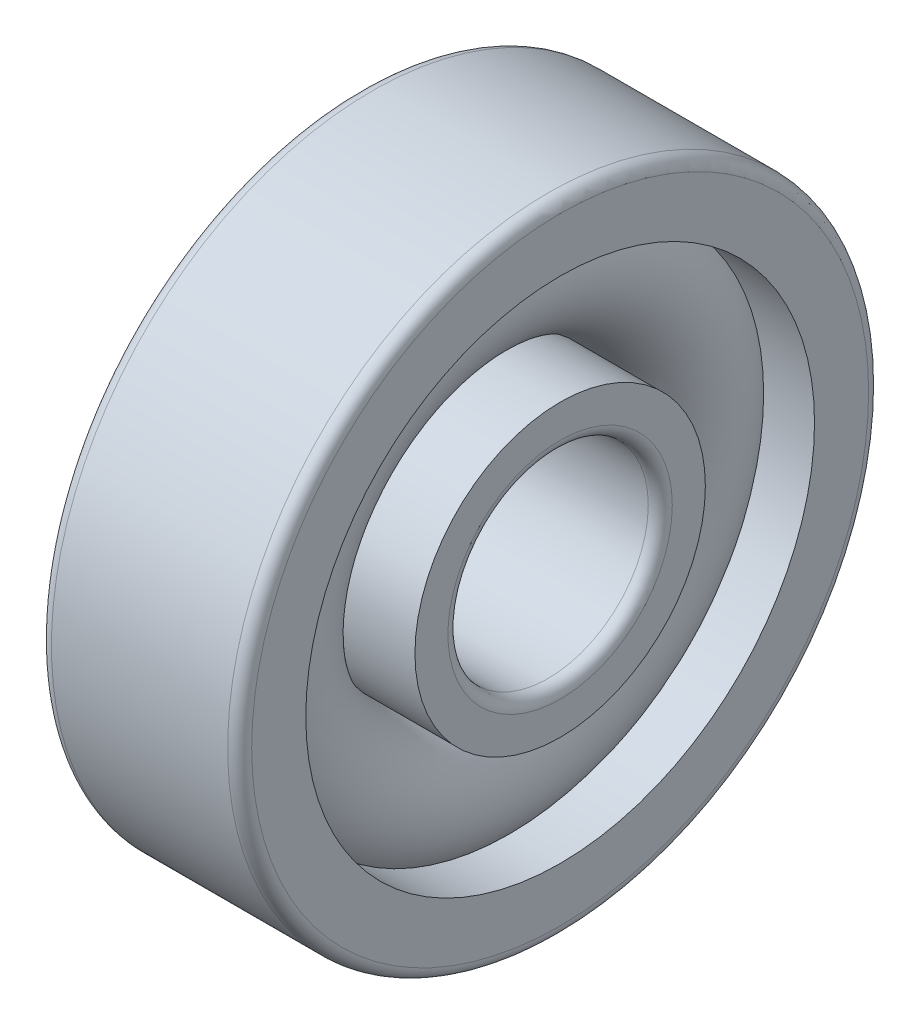
ISO-10303-21;
HEADER;
FILE_DESCRIPTION(('STEP AP214'),'2;1');
FILE_NAME('part.step','',(''),(''),'','','');
FILE_SCHEMA(('AUTOMOTIVE_DESIGN { 1 0 10303 214 1 1 1 1 }'));
ENDSEC;
DATA;
#1=APPLICATION_CONTEXT('core data for automotive mechanical design processes');
#2=APPLICATION_PROTOCOL_DEFINITION('international standard','automotive_design',2000,#1);
#3=PRODUCT_CONTEXT('',#1,'mechanical');
#4=PRODUCT('Part','Part','',(#3));
#5=PRODUCT_RELATED_PRODUCT_CATEGORY('part','',(#4));
#6=PRODUCT_DEFINITION_FORMATION('','',#4);
#7=PRODUCT_DEFINITION_CONTEXT('part definition',#1,'design');
#8=PRODUCT_DEFINITION('design','',#6,#7);
#9=PRODUCT_DEFINITION_SHAPE('','',#8);
#10=(LENGTH_UNIT() NAMED_UNIT(*) SI_UNIT(.MILLI.,.METRE.));
#11=(NAMED_UNIT(*) PLANE_ANGLE_UNIT() SI_UNIT($,.RADIAN.));
#12=(NAMED_UNIT(*) SI_UNIT($,.STERADIAN.) SOLID_ANGLE_UNIT());
#13=UNCERTAINTY_MEASURE_WITH_UNIT(LENGTH_MEASURE(1.E-05),#10,'distance_accuracy_value','');
#14=(GEOMETRIC_REPRESENTATION_CONTEXT(3) GLOBAL_UNCERTAINTY_ASSIGNED_CONTEXT((#13)) GLOBAL_UNIT_ASSIGNED_CONTEXT((#10,
#11,#12)) REPRESENTATION_CONTEXT('',''));
#15=CARTESIAN_POINT('',(0.,0.,0.));
#16=DIRECTION('',(0.,0.,1.));
#17=DIRECTION('',(1.,0.,0.));
#18=AXIS2_PLACEMENT_3D('',#15,#16,#17);
#19=CARTESIAN_POINT('',(0.,0.,0.));
#20=DIRECTION('',(-1.,0.,0.));
#21=DIRECTION('',(0.,0.,1.));
#22=AXIS2_PLACEMENT_3D('',#19,#20,#21);
#23=TOROIDAL_SURFACE('',#22,5.25,1.65);
#24=CARTESIAN_POINT('',(1.22983738762488,0.,0.));
#25=DIRECTION('',(-1.,0.,0.));
#26=DIRECTION('',(0.,0.,1.));
#27=AXIS2_PLACEMENT_3D('',#24,#25,#26);
#28=CIRCLE('',#27,6.35);
#29=CARTESIAN_POINT('',(1.22983738762488,0.,6.35));
#30=VERTEX_POINT('',#29);
#31=EDGE_CURVE('E36',#30,#30,#28,.F.);
#32=ORIENTED_EDGE('',*,*,#31,.T.);
#33=EDGE_LOOP('',(#32));
#34=FACE_BOUND('',#33,.T.);
#35=CARTESIAN_POINT('',(0.286138078556493,0.,0.));
#36=DIRECTION('',(-1.,0.,0.));
#37=DIRECTION('',(0.,0.,1.));
#38=AXIS2_PLACEMENT_3D('',#35,#36,#37);
#39=CIRCLE('',#38,3.625);
#40=CARTESIAN_POINT('',(0.286138078556493,0.,3.625));
#41=VERTEX_POINT('',#40);
#42=EDGE_CURVE('E10',#41,#41,#39,.T.);
#43=ORIENTED_EDGE('',*,*,#42,.T.);
#44=EDGE_LOOP('',(#43));
#45=FACE_BOUND('',#44,.T.);
#46=ADVANCED_FACE('F32',(#34,#45),#23,.T.);
#47=CARTESIAN_POINT('',(-20.6375,0.,0.));
#48=DIRECTION('',(1.,0.,0.));
#49=DIRECTION('',(0.,0.,-1.));
#50=AXIS2_PLACEMENT_3D('',#47,#48,#49);
#51=CYLINDRICAL_SURFACE('',#50,3.625);
#52=CARTESIAN_POINT('',(2.5,0.,0.));
#53=DIRECTION('',(1.,0.,0.));
#54=DIRECTION('',(0.,0.,-1.));
#55=AXIS2_PLACEMENT_3D('',#52,#53,#54);
#56=CIRCLE('',#55,3.625);
#57=CARTESIAN_POINT('',(2.5,0.,-3.625));
#58=VERTEX_POINT('',#57);
#59=EDGE_CURVE('E45',#58,#58,#56,.T.);
#60=ORIENTED_EDGE('',*,*,#59,.F.);
#61=EDGE_LOOP('',(#60));
#62=FACE_BOUND('',#61,.T.);
#63=ORIENTED_EDGE('',*,*,#42,.F.);
#64=EDGE_LOOP('',(#63));
#65=FACE_BOUND('',#64,.T.);
#66=ADVANCED_FACE('F84',(#62,#65),#51,.T.);
#67=CARTESIAN_POINT('',(-20.6375,0.,0.));
#68=DIRECTION('',(1.,0.,0.));
#69=DIRECTION('',(0.,0.,-1.));
#70=AXIS2_PLACEMENT_3D('',#67,#68,#69);
#71=CYLINDRICAL_SURFACE('',#70,4.15);
#72=CARTESIAN_POINT('',(-2.5,0.,0.));
#73=DIRECTION('',(1.,0.,0.));
#74=DIRECTION('',(0.,0.,-1.));
#75=AXIS2_PLACEMENT_3D('',#72,#73,#74);
#76=CIRCLE('',#75,4.15);
#77=CARTESIAN_POINT('',(-2.5,0.,-4.15));
#78=VERTEX_POINT('',#77);
#79=EDGE_CURVE('E54',#78,#78,#76,.T.);
#80=ORIENTED_EDGE('',*,*,#79,.T.);
#81=EDGE_LOOP('',(#80));
#82=FACE_BOUND('',#81,.T.);
#83=CARTESIAN_POINT('',(-1.22983738762488,0.,0.));
#84=DIRECTION('',(1.,0.,0.));
#85=DIRECTION('',(0.,0.,-1.));
#86=AXIS2_PLACEMENT_3D('',#83,#84,#85);
#87=CIRCLE('',#86,4.15);
#88=CARTESIAN_POINT('',(-1.22983738762488,0.,-4.15));
#89=VERTEX_POINT('',#88);
#90=EDGE_CURVE('E40',#89,#89,#87,.T.);
#91=ORIENTED_EDGE('',*,*,#90,.F.);
#92=EDGE_LOOP('',(#91));
#93=FACE_BOUND('',#92,.T.);
#94=ADVANCED_FACE('F87',(#82,#93),#71,.T.);
#95=CARTESIAN_POINT('',(2.5,2.8,0.));
#96=DIRECTION('',(1.,0.,0.));
#97=DIRECTION('',(0.,0.,-1.));
#98=AXIS2_PLACEMENT_3D('',#95,#96,#97);
#99=PLANE('',#98);
#100=ORIENTED_EDGE('',*,*,#59,.T.);
#101=EDGE_LOOP('',(#100));
#102=FACE_BOUND('',#101,.T.);
#103=CARTESIAN_POINT('',(2.5,0.,0.));
#104=DIRECTION('',(1.,0.,0.));
#105=DIRECTION('',(0.,0.,-1.));
#106=AXIS2_PLACEMENT_3D('',#103,#104,#105);
#107=CIRCLE('',#106,2.8);
#108=CARTESIAN_POINT('',(2.5,0.,-2.8));
#109=VERTEX_POINT('',#108);
#110=EDGE_CURVE('E76',#109,#109,#107,.T.);
#111=ORIENTED_EDGE('',*,*,#110,.F.);
#112=EDGE_LOOP('',(#111));
#113=FACE_BOUND('',#112,.T.);
#114=ADVANCED_FACE('F81',(#102,#113),#99,.T.);
#115=CARTESIAN_POINT('',(2.2,0.,0.));
#116=DIRECTION('',(1.,0.,0.));
#117=DIRECTION('',(0.,0.,-1.));
#118=AXIS2_PLACEMENT_3D('',#115,#116,#117);
#119=TOROIDAL_SURFACE('',#118,2.8,0.299999999999999);
#120=ORIENTED_EDGE('',*,*,#110,.T.);
#121=EDGE_LOOP('',(#120));
#122=FACE_BOUND('',#121,.T.);
#123=CARTESIAN_POINT('',(2.2,0.,0.));
#124=DIRECTION('',(1.,0.,0.));
#125=DIRECTION('',(0.,0.,-1.));
#126=AXIS2_PLACEMENT_3D('',#123,#124,#125);
#127=CIRCLE('',#126,2.5);
#128=CARTESIAN_POINT('',(2.2,0.,-2.5));
#129=VERTEX_POINT('',#128);
#130=EDGE_CURVE('E73',#129,#129,#127,.T.);
#131=ORIENTED_EDGE('',*,*,#130,.F.);
#132=EDGE_LOOP('',(#131));
#133=FACE_BOUND('',#132,.T.);
#134=ADVANCED_FACE('F98',(#122,#133),#119,.T.);
#135=CARTESIAN_POINT('',(-20.6375,0.,0.));
#136=DIRECTION('',(1.,0.,0.));
#137=DIRECTION('',(0.,0.,-1.));
#138=AXIS2_PLACEMENT_3D('',#135,#136,#137);
#139=CYLINDRICAL_SURFACE('',#138,2.5);
#140=ORIENTED_EDGE('',*,*,#130,.T.);
#141=EDGE_LOOP('',(#140));
#142=FACE_BOUND('',#141,.T.);
#143=CARTESIAN_POINT('',(-2.2,0.,0.));
#144=DIRECTION('',(1.,0.,0.));
#145=DIRECTION('',(0.,0.,-1.));
#146=AXIS2_PLACEMENT_3D('',#143,#144,#145);
#147=CIRCLE('',#146,2.5);
#148=CARTESIAN_POINT('',(-2.2,0.,-2.5));
#149=VERTEX_POINT('',#148);
#150=EDGE_CURVE('E70',#149,#149,#147,.T.);
#151=ORIENTED_EDGE('',*,*,#150,.F.);
#152=EDGE_LOOP('',(#151));
#153=FACE_BOUND('',#152,.T.);
#154=ADVANCED_FACE('F101',(#142,#153),#139,.F.);
#155=CARTESIAN_POINT('',(-2.2,0.,0.));
#156=DIRECTION('',(1.,0.,0.));
#157=DIRECTION('',(0.,0.,-1.));
#158=AXIS2_PLACEMENT_3D('',#155,#156,#157);
#159=TOROIDAL_SURFACE('',#158,2.8,0.299999999999999);
#160=ORIENTED_EDGE('',*,*,#150,.T.);
#161=EDGE_LOOP('',(#160));
#162=FACE_BOUND('',#161,.T.);
#163=CARTESIAN_POINT('',(-2.5,0.,0.));
#164=DIRECTION('',(1.,0.,0.));
#165=DIRECTION('',(0.,0.,-1.));
#166=AXIS2_PLACEMENT_3D('',#163,#164,#165);
#167=CIRCLE('',#166,2.8);
#168=CARTESIAN_POINT('',(-2.5,0.,-2.8));
#169=VERTEX_POINT('',#168);
#170=EDGE_CURVE('E67',#169,#169,#167,.T.);
#171=ORIENTED_EDGE('',*,*,#170,.F.);
#172=EDGE_LOOP('',(#171));
#173=FACE_BOUND('',#172,.T.);
#174=ADVANCED_FACE('F105',(#162,#173),#159,.T.);
#175=CARTESIAN_POINT('',(-2.5,4.15,0.));
#176=DIRECTION('',(-1.,0.,0.));
#177=DIRECTION('',(0.,0.,1.));
#178=AXIS2_PLACEMENT_3D('',#175,#176,#177);
#179=PLANE('',#178);
#180=ORIENTED_EDGE('',*,*,#170,.T.);
#181=EDGE_LOOP('',(#180));
#182=FACE_BOUND('',#181,.T.);
#183=ORIENTED_EDGE('',*,*,#79,.F.);
#184=EDGE_LOOP('',(#183));
#185=FACE_BOUND('',#184,.T.);
#186=ADVANCED_FACE('F109',(#182,#185),#179,.T.);
#187=CARTESIAN_POINT('',(-0.286138078556493,0.,0.));
#188=DIRECTION('',(1.,0.,0.));
#189=DIRECTION('',(0.,0.,-1.));
#190=AXIS2_PLACEMENT_3D('',#187,#188,#189);
#191=CIRCLE('',#190,6.875);
#192=CARTESIAN_POINT('',(-0.286138078556493,0.,-6.875));
#193=VERTEX_POINT('',#192);
#194=EDGE_CURVE('E48',#193,#193,#191,.F.);
#195=ORIENTED_EDGE('',*,*,#194,.T.);
#196=EDGE_LOOP('',(#195));
#197=FACE_BOUND('',#196,.T.);
#198=ORIENTED_EDGE('',*,*,#90,.T.);
#199=EDGE_LOOP('',(#198));
#200=FACE_BOUND('',#199,.T.);
#201=ADVANCED_FACE('F34',(#197,#200),#23,.T.);
#202=CARTESIAN_POINT('',(-20.6375,0.,0.));
#203=DIRECTION('',(1.,0.,0.));
#204=DIRECTION('',(0.,0.,-1.));
#205=AXIS2_PLACEMENT_3D('',#202,#203,#204);
#206=CYLINDRICAL_SURFACE('',#205,6.35);
#207=CARTESIAN_POINT('',(2.5,0.,0.));
#208=DIRECTION('',(1.,0.,0.));
#209=DIRECTION('',(0.,0.,-1.));
#210=AXIS2_PLACEMENT_3D('',#207,#208,#209);
#211=CIRCLE('',#210,6.35);
#212=CARTESIAN_POINT('',(2.5,0.,-6.35));
#213=VERTEX_POINT('',#212);
#214=EDGE_CURVE('E150',#213,#213,#211,.T.);
#215=ORIENTED_EDGE('',*,*,#214,.T.);
#216=EDGE_LOOP('',(#215));
#217=FACE_BOUND('',#216,.T.);
#218=ORIENTED_EDGE('',*,*,#31,.F.);
#219=EDGE_LOOP('',(#218));
#220=FACE_BOUND('',#219,.T.);
#221=ADVANCED_FACE('F131',(#217,#220),#206,.F.);
#222=CARTESIAN_POINT('',(-20.6375,0.,0.));
#223=DIRECTION('',(1.,0.,0.));
#224=DIRECTION('',(0.,0.,-1.));
#225=AXIS2_PLACEMENT_3D('',#222,#223,#224);
#226=CYLINDRICAL_SURFACE('',#225,6.875);
#227=CARTESIAN_POINT('',(-2.5,0.,0.));
#228=DIRECTION('',(1.,0.,0.));
#229=DIRECTION('',(0.,0.,-1.));
#230=AXIS2_PLACEMENT_3D('',#227,#228,#229);
#231=CIRCLE('',#230,6.875);
#232=CARTESIAN_POINT('',(-2.5,0.,-6.875));
#233=VERTEX_POINT('',#232);
#234=EDGE_CURVE('E145',#233,#233,#231,.T.);
#235=ORIENTED_EDGE('',*,*,#234,.F.);
#236=EDGE_LOOP('',(#235));
#237=FACE_BOUND('',#236,.T.);
#238=ORIENTED_EDGE('',*,*,#194,.F.);
#239=EDGE_LOOP('',(#238));
#240=FACE_BOUND('',#239,.T.);
#241=ADVANCED_FACE('F118',(#237,#240),#226,.F.);
#242=CARTESIAN_POINT('',(-2.2,0.,0.));
#243=DIRECTION('',(1.,0.,0.));
#244=DIRECTION('',(0.,0.,-1.));
#245=AXIS2_PLACEMENT_3D('',#242,#243,#244);
#246=TOROIDAL_SURFACE('',#245,7.7,0.3);
#247=CARTESIAN_POINT('',(-2.5,0.,0.));
#248=DIRECTION('',(1.,0.,0.));
#249=DIRECTION('',(0.,0.,-1.));
#250=AXIS2_PLACEMENT_3D('',#247,#248,#249);
#251=CIRCLE('',#250,7.7);
#252=CARTESIAN_POINT('',(-2.5,0.,-7.7));
#253=VERTEX_POINT('',#252);
#254=EDGE_CURVE('E148',#253,#253,#251,.T.);
#255=ORIENTED_EDGE('',*,*,#254,.T.);
#256=EDGE_LOOP('',(#255));
#257=FACE_BOUND('',#256,.T.);
#258=CARTESIAN_POINT('',(-2.2,0.,0.));
#259=DIRECTION('',(1.,0.,0.));
#260=DIRECTION('',(0.,0.,-1.));
#261=AXIS2_PLACEMENT_3D('',#258,#259,#260);
#262=CIRCLE('',#261,8.);
#263=CARTESIAN_POINT('',(-2.2,0.,-8.));
#264=VERTEX_POINT('',#263);
#265=EDGE_CURVE('E50',#264,#264,#262,.T.);
#266=ORIENTED_EDGE('',*,*,#265,.F.);
#267=EDGE_LOOP('',(#266));
#268=FACE_BOUND('',#267,.T.);
#269=ADVANCED_FACE('F114',(#257,#268),#246,.T.);
#270=CARTESIAN_POINT('',(-20.6375,0.,0.));
#271=DIRECTION('',(1.,0.,0.));
#272=DIRECTION('',(0.,0.,-1.));
#273=AXIS2_PLACEMENT_3D('',#270,#271,#272);
#274=CYLINDRICAL_SURFACE('',#273,8.);
#275=ORIENTED_EDGE('',*,*,#265,.T.);
#276=EDGE_LOOP('',(#275));
#277=FACE_BOUND('',#276,.T.);
#278=CARTESIAN_POINT('',(2.2,0.,0.));
#279=DIRECTION('',(1.,0.,0.));
#280=DIRECTION('',(0.,0.,-1.));
#281=AXIS2_PLACEMENT_3D('',#278,#279,#280);
#282=CIRCLE('',#281,8.);
#283=CARTESIAN_POINT('',(2.2,0.,-8.));
#284=VERTEX_POINT('',#283);
#285=EDGE_CURVE('E56',#284,#284,#282,.T.);
#286=ORIENTED_EDGE('',*,*,#285,.F.);
#287=EDGE_LOOP('',(#286));
#288=FACE_BOUND('',#287,.T.);
#289=ADVANCED_FACE('F117',(#277,#288),#274,.T.);
#290=CARTESIAN_POINT('',(2.2,0.,0.));
#291=DIRECTION('',(1.,0.,0.));
#292=DIRECTION('',(0.,0.,-1.));
#293=AXIS2_PLACEMENT_3D('',#290,#291,#292);
#294=TOROIDAL_SURFACE('',#293,7.7,0.3);
#295=ORIENTED_EDGE('',*,*,#285,.T.);
#296=EDGE_LOOP('',(#295));
#297=FACE_BOUND('',#296,.T.);
#298=CARTESIAN_POINT('',(2.5,0.,0.));
#299=DIRECTION('',(1.,0.,0.));
#300=DIRECTION('',(0.,0.,-1.));
#301=AXIS2_PLACEMENT_3D('',#298,#299,#300);
#302=CIRCLE('',#301,7.7);
#303=CARTESIAN_POINT('',(2.5,0.,-7.7));
#304=VERTEX_POINT('',#303);
#305=EDGE_CURVE('E61',#304,#304,#302,.T.);
#306=ORIENTED_EDGE('',*,*,#305,.F.);
#307=EDGE_LOOP('',(#306));
#308=FACE_BOUND('',#307,.T.);
#309=ADVANCED_FACE('F122',(#297,#308),#294,.T.);
#310=CARTESIAN_POINT('',(2.5,7.7,0.));
#311=DIRECTION('',(1.,0.,0.));
#312=DIRECTION('',(0.,0.,-1.));
#313=AXIS2_PLACEMENT_3D('',#310,#311,#312);
#314=PLANE('',#313);
#315=ORIENTED_EDGE('',*,*,#305,.T.);
#316=EDGE_LOOP('',(#315));
#317=FACE_BOUND('',#316,.T.);
#318=ORIENTED_EDGE('',*,*,#214,.F.);
#319=EDGE_LOOP('',(#318));
#320=FACE_BOUND('',#319,.T.);
#321=ADVANCED_FACE('F125',(#317,#320),#314,.T.);
#322=CARTESIAN_POINT('',(-2.5,6.875,0.));
#323=DIRECTION('',(-1.,0.,0.));
#324=DIRECTION('',(0.,0.,1.));
#325=AXIS2_PLACEMENT_3D('',#322,#323,#324);
#326=PLANE('',#325);
#327=ORIENTED_EDGE('',*,*,#234,.T.);
#328=EDGE_LOOP('',(#327));
#329=FACE_BOUND('',#328,.T.);
#330=ORIENTED_EDGE('',*,*,#254,.F.);
#331=EDGE_LOOP('',(#330));
#332=FACE_BOUND('',#331,.T.);
#333=ADVANCED_FACE('F129',(#329,#332),#326,.T.);
#334=CLOSED_SHELL('',(#46,#66,#94,#114,#134,#154,#174,#186,#201,#221,#241,#269,#289,#309,#321,#333));
#335=MANIFOLD_SOLID_BREP('B2',#334);
#336=ADVANCED_BREP_SHAPE_REPRESENTATION('',(#18,#335),#14);
#337=SHAPE_DEFINITION_REPRESENTATION(#9,#336);
ENDSEC;
END-ISO-10303-21;
